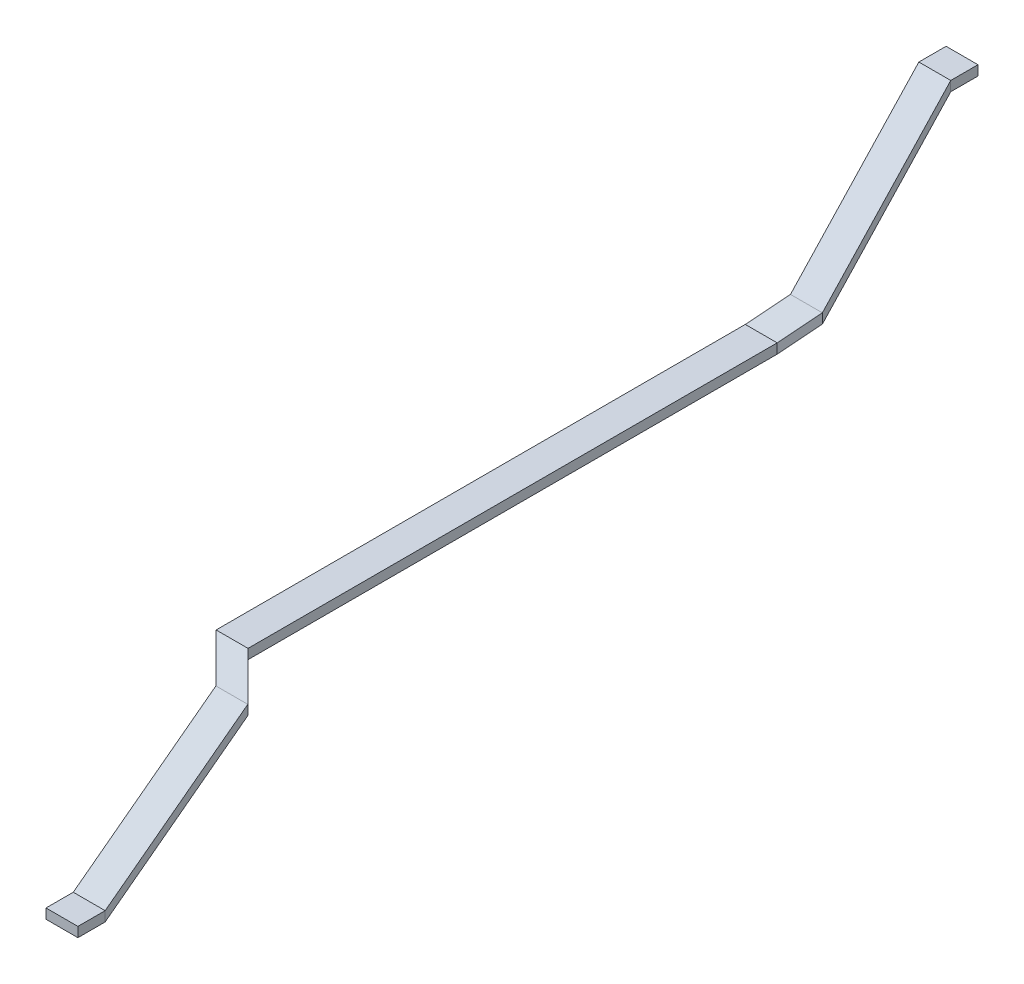
ISO-10303-21;
HEADER;
FILE_DESCRIPTION(('STEP AP214'),'2;1');
FILE_NAME('part.step','',(''),(''),'','','');
FILE_SCHEMA(('AUTOMOTIVE_DESIGN { 1 0 10303 214 1 1 1 1 }'));
ENDSEC;
DATA;
#1=APPLICATION_CONTEXT('core data for automotive mechanical design processes');
#2=APPLICATION_PROTOCOL_DEFINITION('international standard','automotive_design',2000,#1);
#3=PRODUCT_CONTEXT('',#1,'mechanical');
#4=PRODUCT('Part','Part','',(#3));
#5=PRODUCT_RELATED_PRODUCT_CATEGORY('part','',(#4));
#6=PRODUCT_DEFINITION_FORMATION('','',#4);
#7=PRODUCT_DEFINITION_CONTEXT('part definition',#1,'design');
#8=PRODUCT_DEFINITION('design','',#6,#7);
#9=PRODUCT_DEFINITION_SHAPE('','',#8);
#10=(LENGTH_UNIT() NAMED_UNIT(*) SI_UNIT(.MILLI.,.METRE.));
#11=(NAMED_UNIT(*) PLANE_ANGLE_UNIT() SI_UNIT($,.RADIAN.));
#12=(NAMED_UNIT(*) SI_UNIT($,.STERADIAN.) SOLID_ANGLE_UNIT());
#13=UNCERTAINTY_MEASURE_WITH_UNIT(LENGTH_MEASURE(1.E-05),#10,'distance_accuracy_value','');
#14=(GEOMETRIC_REPRESENTATION_CONTEXT(3) GLOBAL_UNCERTAINTY_ASSIGNED_CONTEXT((#13)) GLOBAL_UNIT_ASSIGNED_CONTEXT((#10,
#11,#12)) REPRESENTATION_CONTEXT('',''));
#15=CARTESIAN_POINT('',(0.,0.,0.));
#16=DIRECTION('',(0.,0.,1.));
#17=DIRECTION('',(1.,0.,0.));
#18=AXIS2_PLACEMENT_3D('',#15,#16,#17);
#19=CARTESIAN_POINT('',(0.,0.,-410.));
#20=DIRECTION('',(0.,0.,1.));
#21=DIRECTION('',(1.,0.,0.));
#22=AXIS2_PLACEMENT_3D('',#19,#20,#21);
#23=PLANE('',#22);
#24=DIRECTION('',(0.,-1.,0.));
#25=VECTOR('',#24,1.);
#26=CARTESIAN_POINT('',(3212.66029065679,352.155989281594,-410.));
#27=LINE('',#26,#25);
#28=CARTESIAN_POINT('',(3212.66029065679,352.155989281594,-410.));
#29=VERTEX_POINT('',#28);
#30=CARTESIAN_POINT('',(3212.66029065679,330.555989281594,-410.));
#31=VERTEX_POINT('',#30);
#32=EDGE_CURVE('E152',#29,#31,#27,.T.);
#33=ORIENTED_EDGE('',*,*,#32,.F.);
#34=DIRECTION('',(-1.,0.,0.));
#35=VECTOR('',#34,1.);
#36=CARTESIAN_POINT('',(3212.66029065679,352.155989281594,-410.));
#37=LINE('',#36,#35);
#38=CARTESIAN_POINT('',(3282.91029065679,352.155989281594,-410.));
#39=VERTEX_POINT('',#38);
#40=EDGE_CURVE('E40',#39,#29,#37,.T.);
#41=ORIENTED_EDGE('',*,*,#40,.F.);
#42=DIRECTION('',(0.,1.,0.));
#43=VECTOR('',#42,1.);
#44=CARTESIAN_POINT('',(3282.91029065679,352.155989281594,-410.));
#45=LINE('',#44,#43);
#46=CARTESIAN_POINT('',(3282.91029065679,330.555989281594,-410.));
#47=VERTEX_POINT('',#46);
#48=EDGE_CURVE('E141',#47,#39,#45,.T.);
#49=ORIENTED_EDGE('',*,*,#48,.F.);
#50=DIRECTION('',(1.,0.,0.));
#51=VECTOR('',#50,1.);
#52=CARTESIAN_POINT('',(3212.66029065679,330.555989281594,-410.));
#53=LINE('',#52,#51);
#54=EDGE_CURVE('E135',#31,#47,#53,.T.);
#55=ORIENTED_EDGE('',*,*,#54,.F.);
#56=EDGE_LOOP('',(#33,#41,#49,#55));
#57=FACE_BOUND('',#56,.T.);
#58=ADVANCED_FACE('F37',(#57),#23,.F.);
#59=CARTESIAN_POINT('',(3.39652809837698,-648.683155378033,1575.));
#60=DIRECTION('',(0.,0.,1.));
#61=DIRECTION('',(1.,0.,0.));
#62=AXIS2_PLACEMENT_3D('',#59,#60,#61);
#63=PLANE('',#62);
#64=DIRECTION('',(0.,-1.,0.));
#65=VECTOR('',#64,1.);
#66=CARTESIAN_POINT('',(3216.05681875516,-296.527166096439,1575.));
#67=LINE('',#66,#65);
#68=CARTESIAN_POINT('',(3216.05681875516,-296.527166096439,1575.));
#69=VERTEX_POINT('',#68);
#70=CARTESIAN_POINT('',(3216.05681875516,-318.127166096439,1575.));
#71=VERTEX_POINT('',#70);
#72=EDGE_CURVE('E248',#69,#71,#67,.T.);
#73=ORIENTED_EDGE('',*,*,#72,.T.);
#74=DIRECTION('',(1.,0.,0.));
#75=VECTOR('',#74,1.);
#76=CARTESIAN_POINT('',(3216.05681875516,-318.127166096439,1575.));
#77=LINE('',#76,#75);
#78=CARTESIAN_POINT('',(3286.30681875516,-318.127166096439,1575.));
#79=VERTEX_POINT('',#78);
#80=EDGE_CURVE('E277',#71,#79,#77,.T.);
#81=ORIENTED_EDGE('',*,*,#80,.T.);
#82=DIRECTION('',(0.,1.,0.));
#83=VECTOR('',#82,1.);
#84=CARTESIAN_POINT('',(3286.30681875516,-296.527166096439,1575.));
#85=LINE('',#84,#83);
#86=CARTESIAN_POINT('',(3286.30681875516,-296.527166096439,1575.));
#87=VERTEX_POINT('',#86);
#88=EDGE_CURVE('E270',#79,#87,#85,.T.);
#89=ORIENTED_EDGE('',*,*,#88,.T.);
#90=DIRECTION('',(-1.,0.,0.));
#91=VECTOR('',#90,1.);
#92=CARTESIAN_POINT('',(3216.05681875516,-296.527166096439,1575.));
#93=LINE('',#92,#91);
#94=EDGE_CURVE('E266',#87,#69,#93,.T.);
#95=ORIENTED_EDGE('',*,*,#94,.T.);
#96=EDGE_LOOP('',(#73,#81,#89,#95));
#97=FACE_BOUND('',#96,.T.);
#98=ADVANCED_FACE('F296',(#97),#63,.T.);
#99=CARTESIAN_POINT('',(3212.66029065679,352.155989281594,-350.));
#100=DIRECTION('',(1.,0.,0.));
#101=DIRECTION('',(0.,0.,-1.));
#102=AXIS2_PLACEMENT_3D('',#99,#100,#101);
#103=PLANE('',#102);
#104=DIRECTION('',(0.,0.,-1.));
#105=VECTOR('',#104,1.);
#106=CARTESIAN_POINT('',(3212.66029065679,330.555989281594,-350.));
#107=LINE('',#106,#105);
#108=CARTESIAN_POINT('',(3212.66029065679,330.555989281594,-350.));
#109=VERTEX_POINT('',#108);
#110=EDGE_CURVE('E163',#109,#31,#107,.T.);
#111=ORIENTED_EDGE('',*,*,#110,.F.);
#112=DIRECTION('',(0.,-1.,0.));
#113=VECTOR('',#112,1.);
#114=CARTESIAN_POINT('',(3212.66029065679,352.155989281594,-350.));
#115=LINE('',#114,#113);
#116=CARTESIAN_POINT('',(3212.66029065679,352.155989281594,-350.));
#117=VERTEX_POINT('',#116);
#118=EDGE_CURVE('E182',#117,#109,#115,.T.);
#119=ORIENTED_EDGE('',*,*,#118,.F.);
#120=DIRECTION('',(0.,0.,-1.));
#121=VECTOR('',#120,1.);
#122=CARTESIAN_POINT('',(3212.66029065679,352.155989281594,-350.));
#123=LINE('',#122,#121);
#124=EDGE_CURVE('E164',#117,#29,#123,.T.);
#125=ORIENTED_EDGE('',*,*,#124,.T.);
#126=ORIENTED_EDGE('',*,*,#32,.T.);
#127=EDGE_LOOP('',(#111,#119,#125,#126));
#128=FACE_BOUND('',#127,.T.);
#129=ADVANCED_FACE('F409',(#128),#103,.F.);
#130=CARTESIAN_POINT('',(3212.66029065679,330.555989281594,-350.));
#131=DIRECTION('',(0.,1.,0.));
#132=DIRECTION('',(0.,0.,1.));
#133=AXIS2_PLACEMENT_3D('',#130,#131,#132);
#134=PLANE('',#133);
#135=DIRECTION('',(0.,0.,-1.));
#136=VECTOR('',#135,1.);
#137=CARTESIAN_POINT('',(3282.91029065679,330.555989281594,-350.));
#138=LINE('',#137,#136);
#139=CARTESIAN_POINT('',(3282.91029065679,330.555989281594,-350.));
#140=VERTEX_POINT('',#139);
#141=EDGE_CURVE('E148',#140,#47,#138,.T.);
#142=ORIENTED_EDGE('',*,*,#141,.F.);
#143=DIRECTION('',(1.,0.,0.));
#144=VECTOR('',#143,1.);
#145=CARTESIAN_POINT('',(3212.66029065679,330.555989281594,-350.));
#146=LINE('',#145,#144);
#147=EDGE_CURVE('E177',#109,#140,#146,.T.);
#148=ORIENTED_EDGE('',*,*,#147,.F.);
#149=ORIENTED_EDGE('',*,*,#110,.T.);
#150=ORIENTED_EDGE('',*,*,#54,.T.);
#151=EDGE_LOOP('',(#142,#148,#149,#150));
#152=FACE_BOUND('',#151,.T.);
#153=ADVANCED_FACE('F412',(#152),#134,.F.);
#154=CARTESIAN_POINT('',(3282.91029065679,352.155989281594,-350.));
#155=DIRECTION('',(-1.,0.,0.));
#156=DIRECTION('',(0.,0.,1.));
#157=AXIS2_PLACEMENT_3D('',#154,#155,#156);
#158=PLANE('',#157);
#159=DIRECTION('',(0.,0.,-1.));
#160=VECTOR('',#159,1.);
#161=CARTESIAN_POINT('',(3282.91029065679,352.155989281594,-350.));
#162=LINE('',#161,#160);
#163=CARTESIAN_POINT('',(3282.91029065679,352.155989281594,-350.));
#164=VERTEX_POINT('',#163);
#165=EDGE_CURVE('E146',#164,#39,#162,.T.);
#166=ORIENTED_EDGE('',*,*,#165,.F.);
#167=DIRECTION('',(0.,1.,0.));
#168=VECTOR('',#167,1.);
#169=CARTESIAN_POINT('',(3282.91029065679,352.155989281594,-350.));
#170=LINE('',#169,#168);
#171=EDGE_CURVE('E172',#140,#164,#170,.T.);
#172=ORIENTED_EDGE('',*,*,#171,.F.);
#173=ORIENTED_EDGE('',*,*,#141,.T.);
#174=ORIENTED_EDGE('',*,*,#48,.T.);
#175=EDGE_LOOP('',(#166,#172,#173,#174));
#176=FACE_BOUND('',#175,.T.);
#177=ADVANCED_FACE('F143',(#176),#158,.F.);
#178=CARTESIAN_POINT('',(3212.66029065679,352.155989281594,-350.));
#179=DIRECTION('',(0.,-1.,0.));
#180=DIRECTION('',(0.,0.,-1.));
#181=AXIS2_PLACEMENT_3D('',#178,#179,#180);
#182=PLANE('',#181);
#183=ORIENTED_EDGE('',*,*,#40,.T.);
#184=ORIENTED_EDGE('',*,*,#124,.F.);
#185=DIRECTION('',(-1.,0.,0.));
#186=VECTOR('',#185,1.);
#187=CARTESIAN_POINT('',(3212.66029065679,352.155989281594,-350.));
#188=LINE('',#187,#186);
#189=EDGE_CURVE('E158',#164,#117,#188,.T.);
#190=ORIENTED_EDGE('',*,*,#189,.F.);
#191=ORIENTED_EDGE('',*,*,#165,.T.);
#192=EDGE_LOOP('',(#183,#184,#190,#191));
#193=FACE_BOUND('',#192,.T.);
#194=ADVANCED_FACE('F157',(#193),#182,.F.);
#195=CARTESIAN_POINT('',(3230.05262187985,67.7938873920759,-50.));
#196=DIRECTION('',(0.998323706682824,0.,-0.0578772552482072));
#197=DIRECTION('',(-0.0578772552482072,0.,-0.998323706682824));
#198=AXIS2_PLACEMENT_3D('',#195,#196,#197);
#199=PLANE('',#198);
#200=DIRECTION('',(-0.042038886652964,0.687329721152114,-0.725127979345671));
#201=VECTOR('',#200,1.);
#202=CARTESIAN_POINT('',(3230.05262187985,46.1938873920759,-50.));
#203=LINE('',#202,#201);
#204=CARTESIAN_POINT('',(3230.05262187985,46.1938873920759,-50.));
#205=VERTEX_POINT('',#204);
#206=EDGE_CURVE('E179',#205,#109,#203,.T.);
#207=ORIENTED_EDGE('',*,*,#206,.F.);
#208=DIRECTION('',(0.,-1.,0.));
#209=VECTOR('',#208,1.);
#210=CARTESIAN_POINT('',(3230.05262187985,67.7938873920759,-50.));
#211=LINE('',#210,#209);
#212=CARTESIAN_POINT('',(3230.05262187985,67.7938873920759,-50.));
#213=VERTEX_POINT('',#212);
#214=EDGE_CURVE('E202',#213,#205,#211,.T.);
#215=ORIENTED_EDGE('',*,*,#214,.F.);
#216=DIRECTION('',(-0.042038886652964,0.687329721152114,-0.725127979345671));
#217=VECTOR('',#216,1.);
#218=CARTESIAN_POINT('',(3230.05262187985,67.7938873920759,-50.));
#219=LINE('',#218,#217);
#220=EDGE_CURVE('E156',#213,#117,#219,.T.);
#221=ORIENTED_EDGE('',*,*,#220,.T.);
#222=ORIENTED_EDGE('',*,*,#118,.T.);
#223=EDGE_LOOP('',(#207,#215,#221,#222));
#224=FACE_BOUND('',#223,.T.);
#225=ADVANCED_FACE('F394',(#224),#199,.F.);
#226=CARTESIAN_POINT('',(3230.05262187985,46.1938873920759,-50.));
#227=DIRECTION('',(0.,0.725769577611728,0.68793787525713));
#228=DIRECTION('',(0.,-0.68793787525713,0.725769577611728));
#229=AXIS2_PLACEMENT_3D('',#226,#227,#228);
#230=PLANE('',#229);
#231=DIRECTION('',(-0.042038886652964,0.687329721152114,-0.725127979345671));
#232=VECTOR('',#231,1.);
#233=CARTESIAN_POINT('',(3300.30262187985,46.1938873920759,-50.));
#234=LINE('',#233,#232);
#235=CARTESIAN_POINT('',(3300.30262187985,46.1938873920759,-50.));
#236=VERTEX_POINT('',#235);
#237=EDGE_CURVE('E174',#236,#140,#234,.T.);
#238=ORIENTED_EDGE('',*,*,#237,.F.);
#239=DIRECTION('',(1.,0.,0.));
#240=VECTOR('',#239,1.);
#241=CARTESIAN_POINT('',(3230.05262187985,46.1938873920759,-50.));
#242=LINE('',#241,#240);
#243=EDGE_CURVE('E197',#205,#236,#242,.T.);
#244=ORIENTED_EDGE('',*,*,#243,.F.);
#245=ORIENTED_EDGE('',*,*,#206,.T.);
#246=ORIENTED_EDGE('',*,*,#147,.T.);
#247=EDGE_LOOP('',(#238,#244,#245,#246));
#248=FACE_BOUND('',#247,.T.);
#249=ADVANCED_FACE('F397',(#248),#230,.F.);
#250=CARTESIAN_POINT('',(3300.30262187985,67.7938873920759,-50.));
#251=DIRECTION('',(-0.998323706682824,0.,0.0578772552482072));
#252=DIRECTION('',(0.0578772552482072,0.,0.998323706682824));
#253=AXIS2_PLACEMENT_3D('',#250,#251,#252);
#254=PLANE('',#253);
#255=DIRECTION('',(-0.042038886652964,0.687329721152114,-0.725127979345671));
#256=VECTOR('',#255,1.);
#257=CARTESIAN_POINT('',(3300.30262187985,67.7938873920759,-50.));
#258=LINE('',#257,#256);
#259=CARTESIAN_POINT('',(3300.30262187985,67.7938873920759,-50.));
#260=VERTEX_POINT('',#259);
#261=EDGE_CURVE('E170',#260,#164,#258,.T.);
#262=ORIENTED_EDGE('',*,*,#261,.F.);
#263=DIRECTION('',(0.,1.,0.));
#264=VECTOR('',#263,1.);
#265=CARTESIAN_POINT('',(3300.30262187985,67.7938873920759,-50.));
#266=LINE('',#265,#264);
#267=EDGE_CURVE('E192',#236,#260,#266,.T.);
#268=ORIENTED_EDGE('',*,*,#267,.F.);
#269=ORIENTED_EDGE('',*,*,#237,.T.);
#270=ORIENTED_EDGE('',*,*,#171,.T.);
#271=EDGE_LOOP('',(#262,#268,#269,#270));
#272=FACE_BOUND('',#271,.T.);
#273=ADVANCED_FACE('F401',(#272),#254,.F.);
#274=CARTESIAN_POINT('',(3230.05262187985,67.7938873920759,-50.));
#275=DIRECTION('',(0.,-0.725769577611728,-0.68793787525713));
#276=DIRECTION('',(0.,0.68793787525713,-0.725769577611728));
#277=AXIS2_PLACEMENT_3D('',#274,#275,#276);
#278=PLANE('',#277);
#279=ORIENTED_EDGE('',*,*,#189,.T.);
#280=ORIENTED_EDGE('',*,*,#220,.F.);
#281=DIRECTION('',(-1.,0.,0.));
#282=VECTOR('',#281,1.);
#283=CARTESIAN_POINT('',(3230.05262187985,67.7938873920759,-50.));
#284=LINE('',#283,#282);
#285=EDGE_CURVE('E186',#260,#213,#284,.T.);
#286=ORIENTED_EDGE('',*,*,#285,.F.);
#287=ORIENTED_EDGE('',*,*,#261,.T.);
#288=EDGE_LOOP('',(#279,#280,#286,#287));
#289=FACE_BOUND('',#288,.T.);
#290=ADVANCED_FACE('F382',(#289),#278,.F.);
#291=CARTESIAN_POINT('',(3180.55,10.8,3.88578058618805E-13));
#292=DIRECTION('',(0.710632477772267,0.,0.703563416853981));
#293=DIRECTION('',(0.703563416853981,0.,-0.710632477772267));
#294=AXIS2_PLACEMENT_3D('',#291,#292,#293);
#295=PLANE('',#294);
#296=DIRECTION('',(0.546704586299471,0.62943776400192,-0.552197606448441));
#297=VECTOR('',#296,1.);
#298=CARTESIAN_POINT('',(3180.55,-10.7999999999999,3.88578058618805E-13));
#299=LINE('',#298,#297);
#300=CARTESIAN_POINT('',(3180.55,-10.7999999999999,4.16333634234434E-13));
#301=VERTEX_POINT('',#300);
#302=EDGE_CURVE('E199',#301,#205,#299,.T.);
#303=ORIENTED_EDGE('',*,*,#302,.F.);
#304=DIRECTION('',(0.,-1.,0.));
#305=VECTOR('',#304,1.);
#306=CARTESIAN_POINT('',(3180.55,10.8,3.88578058618805E-13));
#307=LINE('',#306,#305);
#308=CARTESIAN_POINT('',(3180.55,10.8,4.16333634234434E-13));
#309=VERTEX_POINT('',#308);
#310=EDGE_CURVE('E222',#309,#301,#307,.T.);
#311=ORIENTED_EDGE('',*,*,#310,.F.);
#312=DIRECTION('',(0.546704586299471,0.62943776400192,-0.552197606448441));
#313=VECTOR('',#312,1.);
#314=CARTESIAN_POINT('',(3180.55,10.8,3.88578058618805E-13));
#315=LINE('',#314,#313);
#316=EDGE_CURVE('E169',#309,#213,#315,.T.);
#317=ORIENTED_EDGE('',*,*,#316,.T.);
#318=ORIENTED_EDGE('',*,*,#214,.T.);
#319=EDGE_LOOP('',(#303,#311,#317,#318));
#320=FACE_BOUND('',#319,.T.);
#321=ADVANCED_FACE('F378',(#320),#295,.F.);
#322=CARTESIAN_POINT('',(3180.55,-10.7999999999999,3.88578058618805E-13));
#323=DIRECTION('',(0.,0.65947778508545,0.751724052414707));
#324=DIRECTION('',(0.,-0.751724052414707,0.65947778508545));
#325=AXIS2_PLACEMENT_3D('',#322,#323,#324);
#326=PLANE('',#325);
#327=DIRECTION('',(0.546704586299471,0.62943776400192,-0.552197606448441));
#328=VECTOR('',#327,1.);
#329=CARTESIAN_POINT('',(3250.8,-10.7999999999999,3.88578058618805E-13));
#330=LINE('',#329,#328);
#331=CARTESIAN_POINT('',(3250.8,-10.7999999999999,4.16333634234434E-13));
#332=VERTEX_POINT('',#331);
#333=EDGE_CURVE('E194',#332,#236,#330,.T.);
#334=ORIENTED_EDGE('',*,*,#333,.F.);
#335=DIRECTION('',(1.,0.,0.));
#336=VECTOR('',#335,1.);
#337=CARTESIAN_POINT('',(3180.55,-10.7999999999999,3.88578058618805E-13));
#338=LINE('',#337,#336);
#339=EDGE_CURVE('E217',#301,#332,#338,.T.);
#340=ORIENTED_EDGE('',*,*,#339,.F.);
#341=ORIENTED_EDGE('',*,*,#302,.T.);
#342=ORIENTED_EDGE('',*,*,#243,.T.);
#343=EDGE_LOOP('',(#334,#340,#341,#342));
#344=FACE_BOUND('',#343,.T.);
#345=ADVANCED_FACE('F381',(#344),#326,.F.);
#346=CARTESIAN_POINT('',(3250.8,10.8,3.88578058618805E-13));
#347=DIRECTION('',(-0.710632477772267,0.,-0.703563416853981));
#348=DIRECTION('',(-0.703563416853981,0.,0.710632477772267));
#349=AXIS2_PLACEMENT_3D('',#346,#347,#348);
#350=PLANE('',#349);
#351=DIRECTION('',(0.546704586299471,0.62943776400192,-0.552197606448441));
#352=VECTOR('',#351,1.);
#353=CARTESIAN_POINT('',(3250.8,10.8,3.88578058618805E-13));
#354=LINE('',#353,#352);
#355=CARTESIAN_POINT('',(3250.8,10.8,4.16333634234434E-13));
#356=VERTEX_POINT('',#355);
#357=EDGE_CURVE('E189',#356,#260,#354,.T.);
#358=ORIENTED_EDGE('',*,*,#357,.F.);
#359=DIRECTION('',(0.,1.,0.));
#360=VECTOR('',#359,1.);
#361=CARTESIAN_POINT('',(3250.8,10.8,3.88578058618805E-13));
#362=LINE('',#361,#360);
#363=EDGE_CURVE('E212',#332,#356,#362,.T.);
#364=ORIENTED_EDGE('',*,*,#363,.F.);
#365=ORIENTED_EDGE('',*,*,#333,.T.);
#366=ORIENTED_EDGE('',*,*,#267,.T.);
#367=EDGE_LOOP('',(#358,#364,#365,#366));
#368=FACE_BOUND('',#367,.T.);
#369=ADVANCED_FACE('F386',(#368),#350,.F.);
#370=CARTESIAN_POINT('',(3180.55,10.8,3.88578058618805E-13));
#371=DIRECTION('',(0.,-0.65947778508545,-0.751724052414707));
#372=DIRECTION('',(0.,0.751724052414707,-0.65947778508545));
#373=AXIS2_PLACEMENT_3D('',#370,#371,#372);
#374=PLANE('',#373);
#375=ORIENTED_EDGE('',*,*,#285,.T.);
#376=ORIENTED_EDGE('',*,*,#316,.F.);
#377=DIRECTION('',(-1.,0.,0.));
#378=VECTOR('',#377,1.);
#379=CARTESIAN_POINT('',(3180.55,10.8,3.88578058618805E-13));
#380=LINE('',#379,#378);
#381=EDGE_CURVE('E206',#356,#309,#380,.T.);
#382=ORIENTED_EDGE('',*,*,#381,.F.);
#383=ORIENTED_EDGE('',*,*,#357,.T.);
#384=EDGE_LOOP('',(#375,#376,#382,#383));
#385=FACE_BOUND('',#384,.T.);
#386=ADVANCED_FACE('F366',(#385),#374,.F.);
#387=CARTESIAN_POINT('',(3180.55,10.8,1165.));
#388=DIRECTION('',(1.,0.,0.));
#389=DIRECTION('',(0.,0.,-1.));
#390=AXIS2_PLACEMENT_3D('',#387,#388,#389);
#391=PLANE('',#390);
#392=DIRECTION('',(0.,0.,-1.));
#393=VECTOR('',#392,1.);
#394=CARTESIAN_POINT('',(3180.55,-10.7999999999999,1165.));
#395=LINE('',#394,#393);
#396=CARTESIAN_POINT('',(3180.55,-10.7999999999999,1165.));
#397=VERTEX_POINT('',#396);
#398=EDGE_CURVE('E219',#397,#301,#395,.T.);
#399=ORIENTED_EDGE('',*,*,#398,.F.);
#400=DIRECTION('',(0.,-1.,0.));
#401=VECTOR('',#400,1.);
#402=CARTESIAN_POINT('',(3180.55,10.8,1165.));
#403=LINE('',#402,#401);
#404=CARTESIAN_POINT('',(3180.55,10.8,1165.));
#405=VERTEX_POINT('',#404);
#406=EDGE_CURVE('E242',#405,#397,#403,.T.);
#407=ORIENTED_EDGE('',*,*,#406,.F.);
#408=DIRECTION('',(0.,0.,-1.));
#409=VECTOR('',#408,1.);
#410=CARTESIAN_POINT('',(3180.55,10.8,1165.));
#411=LINE('',#410,#409);
#412=EDGE_CURVE('E188',#405,#309,#411,.T.);
#413=ORIENTED_EDGE('',*,*,#412,.T.);
#414=ORIENTED_EDGE('',*,*,#310,.T.);
#415=EDGE_LOOP('',(#399,#407,#413,#414));
#416=FACE_BOUND('',#415,.T.);
#417=ADVANCED_FACE('F362',(#416),#391,.F.);
#418=CARTESIAN_POINT('',(3180.55,-10.7999999999999,1165.));
#419=DIRECTION('',(0.,1.,0.));
#420=DIRECTION('',(0.,0.,1.));
#421=AXIS2_PLACEMENT_3D('',#418,#419,#420);
#422=PLANE('',#421);
#423=DIRECTION('',(0.,0.,-1.));
#424=VECTOR('',#423,1.);
#425=CARTESIAN_POINT('',(3250.8,-10.7999999999999,1165.));
#426=LINE('',#425,#424);
#427=CARTESIAN_POINT('',(3250.8,-10.7999999999999,1165.));
#428=VERTEX_POINT('',#427);
#429=EDGE_CURVE('E214',#428,#332,#426,.T.);
#430=ORIENTED_EDGE('',*,*,#429,.F.);
#431=DIRECTION('',(1.,0.,0.));
#432=VECTOR('',#431,1.);
#433=CARTESIAN_POINT('',(3180.55,-10.7999999999999,1165.));
#434=LINE('',#433,#432);
#435=EDGE_CURVE('E237',#397,#428,#434,.T.);
#436=ORIENTED_EDGE('',*,*,#435,.F.);
#437=ORIENTED_EDGE('',*,*,#398,.T.);
#438=ORIENTED_EDGE('',*,*,#339,.T.);
#439=EDGE_LOOP('',(#430,#436,#437,#438));
#440=FACE_BOUND('',#439,.T.);
#441=ADVANCED_FACE('F365',(#440),#422,.F.);
#442=CARTESIAN_POINT('',(3250.8,10.8,1165.));
#443=DIRECTION('',(-1.,0.,0.));
#444=DIRECTION('',(0.,0.,1.));
#445=AXIS2_PLACEMENT_3D('',#442,#443,#444);
#446=PLANE('',#445);
#447=DIRECTION('',(0.,0.,-1.));
#448=VECTOR('',#447,1.);
#449=CARTESIAN_POINT('',(3250.8,10.8,1165.));
#450=LINE('',#449,#448);
#451=CARTESIAN_POINT('',(3250.8,10.8,1165.));
#452=VERTEX_POINT('',#451);
#453=EDGE_CURVE('E209',#452,#356,#450,.T.);
#454=ORIENTED_EDGE('',*,*,#453,.F.);
#455=DIRECTION('',(0.,1.,0.));
#456=VECTOR('',#455,1.);
#457=CARTESIAN_POINT('',(3250.8,10.8,1165.));
#458=LINE('',#457,#456);
#459=EDGE_CURVE('E232',#428,#452,#458,.T.);
#460=ORIENTED_EDGE('',*,*,#459,.F.);
#461=ORIENTED_EDGE('',*,*,#429,.T.);
#462=ORIENTED_EDGE('',*,*,#363,.T.);
#463=EDGE_LOOP('',(#454,#460,#461,#462));
#464=FACE_BOUND('',#463,.T.);
#465=ADVANCED_FACE('F370',(#464),#446,.F.);
#466=CARTESIAN_POINT('',(3180.55,10.8,1165.));
#467=DIRECTION('',(0.,-1.,0.));
#468=DIRECTION('',(0.,0.,-1.));
#469=AXIS2_PLACEMENT_3D('',#466,#467,#468);
#470=PLANE('',#469);
#471=ORIENTED_EDGE('',*,*,#381,.T.);
#472=ORIENTED_EDGE('',*,*,#412,.F.);
#473=DIRECTION('',(-1.,0.,0.));
#474=VECTOR('',#473,1.);
#475=CARTESIAN_POINT('',(3180.55,10.8,1165.));
#476=LINE('',#475,#474);
#477=EDGE_CURVE('E226',#452,#405,#476,.T.);
#478=ORIENTED_EDGE('',*,*,#477,.F.);
#479=ORIENTED_EDGE('',*,*,#453,.T.);
#480=EDGE_LOOP('',(#471,#472,#478,#479));
#481=FACE_BOUND('',#480,.T.);
#482=ADVANCED_FACE('F350',(#481),#470,.F.);
#483=CARTESIAN_POINT('',(3230.05262187985,-46.1938873920758,1215.));
#484=DIRECTION('',(0.710632477772261,0.,-0.703563416853987));
#485=DIRECTION('',(-0.703563416853987,0.,-0.710632477772261));
#486=AXIS2_PLACEMENT_3D('',#483,#484,#485);
#487=PLANE('',#486);
#488=DIRECTION('',(-0.546704586299474,0.629437764001923,-0.552197606448435));
#489=VECTOR('',#488,1.);
#490=CARTESIAN_POINT('',(3230.05262187985,-67.7938873920758,1215.));
#491=LINE('',#490,#489);
#492=CARTESIAN_POINT('',(3230.05262187985,-67.7938873920758,1215.));
#493=VERTEX_POINT('',#492);
#494=EDGE_CURVE('E239',#493,#397,#491,.T.);
#495=ORIENTED_EDGE('',*,*,#494,.F.);
#496=DIRECTION('',(0.,-1.,0.));
#497=VECTOR('',#496,1.);
#498=CARTESIAN_POINT('',(3230.05262187985,-46.1938873920758,1215.));
#499=LINE('',#498,#497);
#500=CARTESIAN_POINT('',(3230.05262187985,-46.1938873920758,1215.));
#501=VERTEX_POINT('',#500);
#502=EDGE_CURVE('E262',#501,#493,#499,.T.);
#503=ORIENTED_EDGE('',*,*,#502,.F.);
#504=DIRECTION('',(-0.546704586299474,0.629437764001923,-0.552197606448435));
#505=VECTOR('',#504,1.);
#506=CARTESIAN_POINT('',(3230.05262187985,-46.1938873920758,1215.));
#507=LINE('',#506,#505);
#508=EDGE_CURVE('E208',#501,#405,#507,.T.);
#509=ORIENTED_EDGE('',*,*,#508,.T.);
#510=ORIENTED_EDGE('',*,*,#406,.T.);
#511=EDGE_LOOP('',(#495,#503,#509,#510));
#512=FACE_BOUND('',#511,.T.);
#513=ADVANCED_FACE('F346',(#512),#487,.F.);
#514=CARTESIAN_POINT('',(3230.05262187985,-67.7938873920758,1215.));
#515=DIRECTION('',(0.,0.659477785085443,0.751724052414713));
#516=DIRECTION('',(0.,-0.751724052414713,0.659477785085443));
#517=AXIS2_PLACEMENT_3D('',#514,#515,#516);
#518=PLANE('',#517);
#519=DIRECTION('',(-0.546704586299474,0.629437764001923,-0.552197606448435));
#520=VECTOR('',#519,1.);
#521=CARTESIAN_POINT('',(3300.30262187985,-67.7938873920758,1215.));
#522=LINE('',#521,#520);
#523=CARTESIAN_POINT('',(3300.30262187985,-67.7938873920758,1215.));
#524=VERTEX_POINT('',#523);
#525=EDGE_CURVE('E234',#524,#428,#522,.T.);
#526=ORIENTED_EDGE('',*,*,#525,.F.);
#527=DIRECTION('',(1.,0.,0.));
#528=VECTOR('',#527,1.);
#529=CARTESIAN_POINT('',(3230.05262187985,-67.7938873920758,1215.));
#530=LINE('',#529,#528);
#531=EDGE_CURVE('E257',#493,#524,#530,.T.);
#532=ORIENTED_EDGE('',*,*,#531,.F.);
#533=ORIENTED_EDGE('',*,*,#494,.T.);
#534=ORIENTED_EDGE('',*,*,#435,.T.);
#535=EDGE_LOOP('',(#526,#532,#533,#534));
#536=FACE_BOUND('',#535,.T.);
#537=ADVANCED_FACE('F349',(#536),#518,.F.);
#538=CARTESIAN_POINT('',(3300.30262187985,-46.1938873920758,1215.));
#539=DIRECTION('',(-0.710632477772261,0.,0.703563416853987));
#540=DIRECTION('',(0.703563416853987,0.,0.710632477772261));
#541=AXIS2_PLACEMENT_3D('',#538,#539,#540);
#542=PLANE('',#541);
#543=DIRECTION('',(-0.546704586299474,0.629437764001923,-0.552197606448435));
#544=VECTOR('',#543,1.);
#545=CARTESIAN_POINT('',(3300.30262187985,-46.1938873920758,1215.));
#546=LINE('',#545,#544);
#547=CARTESIAN_POINT('',(3300.30262187985,-46.1938873920758,1215.));
#548=VERTEX_POINT('',#547);
#549=EDGE_CURVE('E229',#548,#452,#546,.T.);
#550=ORIENTED_EDGE('',*,*,#549,.F.);
#551=DIRECTION('',(0.,1.,0.));
#552=VECTOR('',#551,1.);
#553=CARTESIAN_POINT('',(3300.30262187985,-46.1938873920758,1215.));
#554=LINE('',#553,#552);
#555=EDGE_CURVE('E252',#524,#548,#554,.T.);
#556=ORIENTED_EDGE('',*,*,#555,.F.);
#557=ORIENTED_EDGE('',*,*,#525,.T.);
#558=ORIENTED_EDGE('',*,*,#459,.T.);
#559=EDGE_LOOP('',(#550,#556,#557,#558));
#560=FACE_BOUND('',#559,.T.);
#561=ADVANCED_FACE('F354',(#560),#542,.F.);
#562=CARTESIAN_POINT('',(3230.05262187985,-46.1938873920758,1215.));
#563=DIRECTION('',(0.,-0.659477785085443,-0.751724052414713));
#564=DIRECTION('',(0.,0.751724052414713,-0.659477785085443));
#565=AXIS2_PLACEMENT_3D('',#562,#563,#564);
#566=PLANE('',#565);
#567=ORIENTED_EDGE('',*,*,#477,.T.);
#568=ORIENTED_EDGE('',*,*,#508,.F.);
#569=DIRECTION('',(-1.,0.,0.));
#570=VECTOR('',#569,1.);
#571=CARTESIAN_POINT('',(3230.05262187985,-46.1938873920758,1215.));
#572=LINE('',#571,#570);
#573=EDGE_CURVE('E246',#548,#501,#572,.T.);
#574=ORIENTED_EDGE('',*,*,#573,.F.);
#575=ORIENTED_EDGE('',*,*,#549,.T.);
#576=EDGE_LOOP('',(#567,#568,#574,#575));
#577=FACE_BOUND('',#576,.T.);
#578=ADVANCED_FACE('F333',(#577),#566,.F.);
#579=CARTESIAN_POINT('',(3216.05681875516,-296.527166096439,1515.));
#580=DIRECTION('',(0.998913537031614,0.,0.0466019906762558));
#581=DIRECTION('',(0.0466019906762558,0.,-0.998913537031614));
#582=AXIS2_PLACEMENT_3D('',#579,#580,#581);
#583=PLANE('',#582);
#584=DIRECTION('',(0.0357970432885086,0.640277026941703,-0.767309520638507));
#585=VECTOR('',#584,1.);
#586=CARTESIAN_POINT('',(3216.05681875516,-318.127166096439,1515.));
#587=LINE('',#586,#585);
#588=CARTESIAN_POINT('',(3216.05681875516,-318.127166096439,1515.));
#589=VERTEX_POINT('',#588);
#590=EDGE_CURVE('E259',#589,#493,#587,.T.);
#591=ORIENTED_EDGE('',*,*,#590,.F.);
#592=DIRECTION('',(0.,-1.,0.));
#593=VECTOR('',#592,1.);
#594=CARTESIAN_POINT('',(3216.05681875516,-296.527166096439,1515.));
#595=LINE('',#594,#593);
#596=CARTESIAN_POINT('',(3216.05681875516,-296.527166096439,1515.));
#597=VERTEX_POINT('',#596);
#598=EDGE_CURVE('E286',#597,#589,#595,.T.);
#599=ORIENTED_EDGE('',*,*,#598,.F.);
#600=DIRECTION('',(0.0357970432885086,0.640277026941703,-0.767309520638507));
#601=VECTOR('',#600,1.);
#602=CARTESIAN_POINT('',(3216.05681875516,-296.527166096439,1515.));
#603=LINE('',#602,#601);
#604=EDGE_CURVE('E228',#597,#501,#603,.T.);
#605=ORIENTED_EDGE('',*,*,#604,.T.);
#606=ORIENTED_EDGE('',*,*,#502,.T.);
#607=EDGE_LOOP('',(#591,#599,#605,#606));
#608=FACE_BOUND('',#607,.T.);
#609=ADVANCED_FACE('F329',(#608),#583,.F.);
#610=CARTESIAN_POINT('',(3216.05681875516,-318.127166096439,1515.));
#611=DIRECTION('',(0.,0.767801619701744,0.640687656181528));
#612=DIRECTION('',(0.,-0.640687656181528,0.767801619701744));
#613=AXIS2_PLACEMENT_3D('',#610,#611,#612);
#614=PLANE('',#613);
#615=DIRECTION('',(0.0357970432885086,0.640277026941703,-0.767309520638507));
#616=VECTOR('',#615,1.);
#617=CARTESIAN_POINT('',(3286.30681875516,-318.127166096439,1515.));
#618=LINE('',#617,#616);
#619=CARTESIAN_POINT('',(3286.30681875516,-318.127166096439,1515.));
#620=VERTEX_POINT('',#619);
#621=EDGE_CURVE('E254',#620,#524,#618,.T.);
#622=ORIENTED_EDGE('',*,*,#621,.F.);
#623=DIRECTION('',(1.,0.,0.));
#624=VECTOR('',#623,1.);
#625=CARTESIAN_POINT('',(3216.05681875516,-318.127166096439,1515.));
#626=LINE('',#625,#624);
#627=EDGE_CURVE('E279',#589,#620,#626,.T.);
#628=ORIENTED_EDGE('',*,*,#627,.F.);
#629=ORIENTED_EDGE('',*,*,#590,.T.);
#630=ORIENTED_EDGE('',*,*,#531,.T.);
#631=EDGE_LOOP('',(#622,#628,#629,#630));
#632=FACE_BOUND('',#631,.T.);
#633=ADVANCED_FACE('F332',(#632),#614,.F.);
#634=CARTESIAN_POINT('',(3286.30681875516,-296.527166096439,1515.));
#635=DIRECTION('',(-0.998913537031614,0.,-0.0466019906762558));
#636=DIRECTION('',(-0.0466019906762558,0.,0.998913537031614));
#637=AXIS2_PLACEMENT_3D('',#634,#635,#636);
#638=PLANE('',#637);
#639=DIRECTION('',(0.0357970432885086,0.640277026941703,-0.767309520638507));
#640=VECTOR('',#639,1.);
#641=CARTESIAN_POINT('',(3286.30681875516,-296.527166096439,1515.));
#642=LINE('',#641,#640);
#643=CARTESIAN_POINT('',(3286.30681875516,-296.527166096439,1515.));
#644=VERTEX_POINT('',#643);
#645=EDGE_CURVE('E249',#644,#548,#642,.T.);
#646=ORIENTED_EDGE('',*,*,#645,.F.);
#647=DIRECTION('',(0.,1.,0.));
#648=VECTOR('',#647,1.);
#649=CARTESIAN_POINT('',(3286.30681875516,-296.527166096439,1515.));
#650=LINE('',#649,#648);
#651=EDGE_CURVE('E55',#620,#644,#650,.T.);
#652=ORIENTED_EDGE('',*,*,#651,.F.);
#653=ORIENTED_EDGE('',*,*,#621,.T.);
#654=ORIENTED_EDGE('',*,*,#555,.T.);
#655=EDGE_LOOP('',(#646,#652,#653,#654));
#656=FACE_BOUND('',#655,.T.);
#657=ADVANCED_FACE('F337',(#656),#638,.F.);
#658=CARTESIAN_POINT('',(3216.05681875516,-296.527166096439,1515.));
#659=DIRECTION('',(0.,-0.767801619701744,-0.640687656181528));
#660=DIRECTION('',(0.,0.640687656181528,-0.767801619701744));
#661=AXIS2_PLACEMENT_3D('',#658,#659,#660);
#662=PLANE('',#661);
#663=ORIENTED_EDGE('',*,*,#573,.T.);
#664=ORIENTED_EDGE('',*,*,#604,.F.);
#665=DIRECTION('',(-1.,0.,0.));
#666=VECTOR('',#665,1.);
#667=CARTESIAN_POINT('',(3216.05681875516,-296.527166096439,1515.));
#668=LINE('',#667,#666);
#669=EDGE_CURVE('E11',#644,#597,#668,.T.);
#670=ORIENTED_EDGE('',*,*,#669,.F.);
#671=ORIENTED_EDGE('',*,*,#645,.T.);
#672=EDGE_LOOP('',(#663,#664,#670,#671));
#673=FACE_BOUND('',#672,.T.);
#674=ADVANCED_FACE('F341',(#673),#662,.F.);
#675=CARTESIAN_POINT('',(3216.05681875516,-296.527166096439,1575.));
#676=DIRECTION('',(1.,0.,0.));
#677=DIRECTION('',(0.,0.,-1.));
#678=AXIS2_PLACEMENT_3D('',#675,#676,#677);
#679=PLANE('',#678);
#680=DIRECTION('',(0.,0.,-1.));
#681=VECTOR('',#680,1.);
#682=CARTESIAN_POINT('',(3216.05681875516,-318.127166096439,1575.));
#683=LINE('',#682,#681);
#684=EDGE_CURVE('E281',#71,#589,#683,.T.);
#685=ORIENTED_EDGE('',*,*,#684,.F.);
#686=ORIENTED_EDGE('',*,*,#72,.F.);
#687=DIRECTION('',(0.,0.,-1.));
#688=VECTOR('',#687,1.);
#689=CARTESIAN_POINT('',(3216.05681875516,-296.527166096439,1575.));
#690=LINE('',#689,#688);
#691=EDGE_CURVE('E269',#69,#597,#690,.T.);
#692=ORIENTED_EDGE('',*,*,#691,.T.);
#693=ORIENTED_EDGE('',*,*,#598,.T.);
#694=EDGE_LOOP('',(#685,#686,#692,#693));
#695=FACE_BOUND('',#694,.T.);
#696=ADVANCED_FACE('F304',(#695),#679,.F.);
#697=CARTESIAN_POINT('',(3216.05681875516,-318.127166096439,1575.));
#698=DIRECTION('',(0.,1.,0.));
#699=DIRECTION('',(0.,0.,1.));
#700=AXIS2_PLACEMENT_3D('',#697,#698,#699);
#701=PLANE('',#700);
#702=DIRECTION('',(0.,0.,-1.));
#703=VECTOR('',#702,1.);
#704=CARTESIAN_POINT('',(3286.30681875516,-318.127166096439,1575.));
#705=LINE('',#704,#703);
#706=EDGE_CURVE('E274',#79,#620,#705,.T.);
#707=ORIENTED_EDGE('',*,*,#706,.F.);
#708=ORIENTED_EDGE('',*,*,#80,.F.);
#709=ORIENTED_EDGE('',*,*,#684,.T.);
#710=ORIENTED_EDGE('',*,*,#627,.T.);
#711=EDGE_LOOP('',(#707,#708,#709,#710));
#712=FACE_BOUND('',#711,.T.);
#713=ADVANCED_FACE('F308',(#712),#701,.F.);
#714=CARTESIAN_POINT('',(3286.30681875516,-296.527166096439,1575.));
#715=DIRECTION('',(-1.,0.,0.));
#716=DIRECTION('',(0.,0.,1.));
#717=AXIS2_PLACEMENT_3D('',#714,#715,#716);
#718=PLANE('',#717);
#719=DIRECTION('',(0.,0.,-1.));
#720=VECTOR('',#719,1.);
#721=CARTESIAN_POINT('',(3286.30681875516,-296.527166096439,1575.));
#722=LINE('',#721,#720);
#723=EDGE_CURVE('E46',#87,#644,#722,.T.);
#724=ORIENTED_EDGE('',*,*,#723,.F.);
#725=ORIENTED_EDGE('',*,*,#88,.F.);
#726=ORIENTED_EDGE('',*,*,#706,.T.);
#727=ORIENTED_EDGE('',*,*,#651,.T.);
#728=EDGE_LOOP('',(#724,#725,#726,#727));
#729=FACE_BOUND('',#728,.T.);
#730=ADVANCED_FACE('F318',(#729),#718,.F.);
#731=CARTESIAN_POINT('',(3216.05681875516,-296.527166096439,1575.));
#732=DIRECTION('',(0.,-1.,0.));
#733=DIRECTION('',(0.,0.,-1.));
#734=AXIS2_PLACEMENT_3D('',#731,#732,#733);
#735=PLANE('',#734);
#736=ORIENTED_EDGE('',*,*,#669,.T.);
#737=ORIENTED_EDGE('',*,*,#691,.F.);
#738=ORIENTED_EDGE('',*,*,#94,.F.);
#739=ORIENTED_EDGE('',*,*,#723,.T.);
#740=EDGE_LOOP('',(#736,#737,#738,#739));
#741=FACE_BOUND('',#740,.T.);
#742=ADVANCED_FACE('F317',(#741),#735,.F.);
#743=CLOSED_SHELL('',(#58,#98,#129,#153,#177,#194,#225,#249,#273,#290,#321,#345,#369,#386,#417,
#441,#465,#482,#513,#537,#561,#578,#609,#633,#657,#674,#696,#713,#730,#742));
#744=MANIFOLD_SOLID_BREP('B2',#743);
#745=ADVANCED_BREP_SHAPE_REPRESENTATION('',(#18,#744),#14);
#746=SHAPE_DEFINITION_REPRESENTATION(#9,#745);
ENDSEC;
END-ISO-10303-21;
